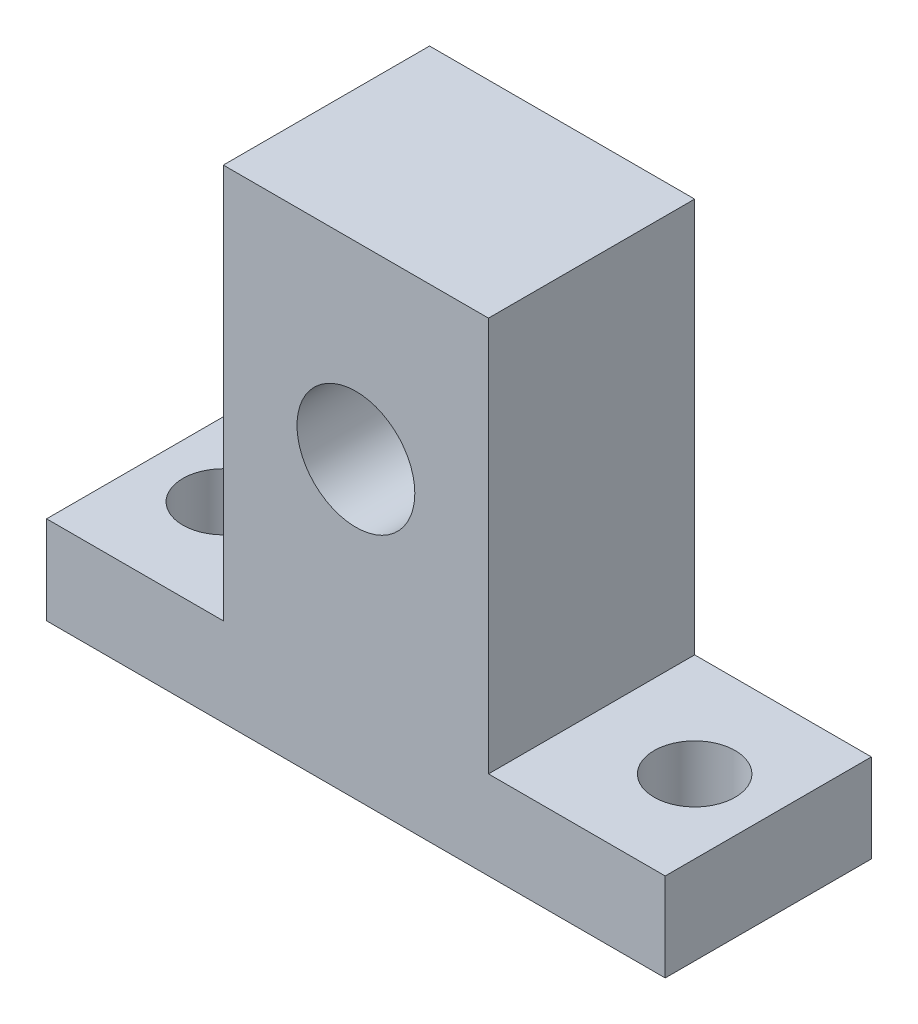
ISO-10303-21;
HEADER;
FILE_DESCRIPTION(('STEP AP214'),'2;1');
FILE_NAME('part.step','',(''),(''),'','','');
FILE_SCHEMA(('AUTOMOTIVE_DESIGN { 1 0 10303 214 1 1 1 1 }'));
ENDSEC;
DATA;
#1=APPLICATION_CONTEXT('core data for automotive mechanical design processes');
#2=APPLICATION_PROTOCOL_DEFINITION('international standard','automotive_design',2000,#1);
#3=PRODUCT_CONTEXT('',#1,'mechanical');
#4=PRODUCT('Part','Part','',(#3));
#5=PRODUCT_RELATED_PRODUCT_CATEGORY('part','',(#4));
#6=PRODUCT_DEFINITION_FORMATION('','',#4);
#7=PRODUCT_DEFINITION_CONTEXT('part definition',#1,'design');
#8=PRODUCT_DEFINITION('design','',#6,#7);
#9=PRODUCT_DEFINITION_SHAPE('','',#8);
#10=(LENGTH_UNIT() NAMED_UNIT(*) SI_UNIT(.MILLI.,.METRE.));
#11=(NAMED_UNIT(*) PLANE_ANGLE_UNIT() SI_UNIT($,.RADIAN.));
#12=(NAMED_UNIT(*) SI_UNIT($,.STERADIAN.) SOLID_ANGLE_UNIT());
#13=UNCERTAINTY_MEASURE_WITH_UNIT(LENGTH_MEASURE(1.E-05),#10,'distance_accuracy_value','');
#14=(GEOMETRIC_REPRESENTATION_CONTEXT(3) GLOBAL_UNCERTAINTY_ASSIGNED_CONTEXT((#13)) GLOBAL_UNIT_ASSIGNED_CONTEXT((#10,
#11,#12)) REPRESENTATION_CONTEXT('',''));
#15=CARTESIAN_POINT('',(0.,0.,0.));
#16=DIRECTION('',(0.,0.,1.));
#17=DIRECTION('',(1.,0.,0.));
#18=AXIS2_PLACEMENT_3D('',#15,#16,#17);
#19=CARTESIAN_POINT('',(0.,0.,14.));
#20=DIRECTION('',(0.,0.,1.));
#21=DIRECTION('',(1.,0.,0.));
#22=AXIS2_PLACEMENT_3D('',#19,#20,#21);
#23=PLANE('',#22);
#24=DIRECTION('',(0.,1.,0.));
#25=VECTOR('',#24,1.);
#26=CARTESIAN_POINT('',(21.,0.,14.));
#27=LINE('',#26,#25);
#28=CARTESIAN_POINT('',(21.,0.,14.));
#29=VERTEX_POINT('',#28);
#30=CARTESIAN_POINT('',(21.,6.,14.));
#31=VERTEX_POINT('',#30);
#32=EDGE_CURVE('E146',#29,#31,#27,.T.);
#33=ORIENTED_EDGE('',*,*,#32,.T.);
#34=DIRECTION('',(-1.,0.,0.));
#35=VECTOR('',#34,1.);
#36=CARTESIAN_POINT('',(21.,6.,14.));
#37=LINE('',#36,#35);
#38=CARTESIAN_POINT('',(9.,6.,14.));
#39=VERTEX_POINT('',#38);
#40=EDGE_CURVE('E94',#31,#39,#37,.T.);
#41=ORIENTED_EDGE('',*,*,#40,.T.);
#42=DIRECTION('',(0.,1.,0.));
#43=VECTOR('',#42,1.);
#44=CARTESIAN_POINT('',(9.,6.,14.));
#45=LINE('',#44,#43);
#46=CARTESIAN_POINT('',(9.,32.8,14.));
#47=VERTEX_POINT('',#46);
#48=EDGE_CURVE('E161',#39,#47,#45,.T.);
#49=ORIENTED_EDGE('',*,*,#48,.T.);
#50=DIRECTION('',(-1.,0.,0.));
#51=VECTOR('',#50,1.);
#52=CARTESIAN_POINT('',(9.,32.8,14.));
#53=LINE('',#52,#51);
#54=CARTESIAN_POINT('',(-9.,32.8,14.));
#55=VERTEX_POINT('',#54);
#56=EDGE_CURVE('E174',#47,#55,#53,.T.);
#57=ORIENTED_EDGE('',*,*,#56,.T.);
#58=DIRECTION('',(0.,-1.,0.));
#59=VECTOR('',#58,1.);
#60=CARTESIAN_POINT('',(-9.,32.8,14.));
#61=LINE('',#60,#59);
#62=CARTESIAN_POINT('',(-9.,5.99999999999999,14.));
#63=VERTEX_POINT('',#62);
#64=EDGE_CURVE('E113',#55,#63,#61,.T.);
#65=ORIENTED_EDGE('',*,*,#64,.T.);
#66=DIRECTION('',(-1.,0.,0.));
#67=VECTOR('',#66,1.);
#68=CARTESIAN_POINT('',(-9.,5.99999999999999,14.));
#69=LINE('',#68,#67);
#70=CARTESIAN_POINT('',(-21.,5.99999999999999,14.));
#71=VERTEX_POINT('',#70);
#72=EDGE_CURVE('E107',#63,#71,#69,.T.);
#73=ORIENTED_EDGE('',*,*,#72,.T.);
#74=DIRECTION('',(0.,-1.,0.));
#75=VECTOR('',#74,1.);
#76=CARTESIAN_POINT('',(-21.,5.99999999999999,14.));
#77=LINE('',#76,#75);
#78=CARTESIAN_POINT('',(-21.,0.,14.));
#79=VERTEX_POINT('',#78);
#80=EDGE_CURVE('E111',#71,#79,#77,.T.);
#81=ORIENTED_EDGE('',*,*,#80,.T.);
#82=DIRECTION('',(1.,0.,0.));
#83=VECTOR('',#82,1.);
#84=CARTESIAN_POINT('',(-21.,0.,14.));
#85=LINE('',#84,#83);
#86=EDGE_CURVE('E51',#79,#29,#85,.T.);
#87=ORIENTED_EDGE('',*,*,#86,.T.);
#88=EDGE_LOOP('',(#33,#41,#49,#57,#65,#73,#81,#87));
#89=FACE_BOUND('',#88,.T.);
#90=CARTESIAN_POINT('',(0.,20.,14.));
#91=DIRECTION('',(0.,0.,1.));
#92=DIRECTION('',(1.,0.,0.));
#93=AXIS2_PLACEMENT_3D('',#90,#91,#92);
#94=CIRCLE('',#93,4.);
#95=CARTESIAN_POINT('',(4.,20.,14.));
#96=VERTEX_POINT('',#95);
#97=EDGE_CURVE('E135',#96,#96,#94,.T.);
#98=ORIENTED_EDGE('',*,*,#97,.F.);
#99=EDGE_LOOP('',(#98));
#100=FACE_BOUND('',#99,.T.);
#101=ADVANCED_FACE('F34',(#89,#100),#23,.T.);
#102=CARTESIAN_POINT('',(0.,0.,0.));
#103=DIRECTION('',(0.,0.,1.));
#104=DIRECTION('',(1.,0.,0.));
#105=AXIS2_PLACEMENT_3D('',#102,#103,#104);
#106=PLANE('',#105);
#107=DIRECTION('',(0.,1.,0.));
#108=VECTOR('',#107,1.);
#109=CARTESIAN_POINT('',(21.,0.,0.));
#110=LINE('',#109,#108);
#111=CARTESIAN_POINT('',(21.,0.,0.));
#112=VERTEX_POINT('',#111);
#113=CARTESIAN_POINT('',(21.,6.,0.));
#114=VERTEX_POINT('',#113);
#115=EDGE_CURVE('E131',#112,#114,#110,.T.);
#116=ORIENTED_EDGE('',*,*,#115,.F.);
#117=DIRECTION('',(1.,0.,0.));
#118=VECTOR('',#117,1.);
#119=CARTESIAN_POINT('',(-21.,0.,0.));
#120=LINE('',#119,#118);
#121=CARTESIAN_POINT('',(-21.,0.,0.));
#122=VERTEX_POINT('',#121);
#123=EDGE_CURVE('E86',#122,#112,#120,.T.);
#124=ORIENTED_EDGE('',*,*,#123,.F.);
#125=DIRECTION('',(0.,-1.,0.));
#126=VECTOR('',#125,1.);
#127=CARTESIAN_POINT('',(-21.,5.99999999999999,0.));
#128=LINE('',#127,#126);
#129=CARTESIAN_POINT('',(-21.,5.99999999999999,0.));
#130=VERTEX_POINT('',#129);
#131=EDGE_CURVE('E80',#130,#122,#128,.T.);
#132=ORIENTED_EDGE('',*,*,#131,.F.);
#133=DIRECTION('',(-1.,0.,0.));
#134=VECTOR('',#133,1.);
#135=CARTESIAN_POINT('',(-9.,5.99999999999999,0.));
#136=LINE('',#135,#134);
#137=CARTESIAN_POINT('',(-9.,5.99999999999999,0.));
#138=VERTEX_POINT('',#137);
#139=EDGE_CURVE('E121',#138,#130,#136,.T.);
#140=ORIENTED_EDGE('',*,*,#139,.F.);
#141=DIRECTION('',(0.,-1.,0.));
#142=VECTOR('',#141,1.);
#143=CARTESIAN_POINT('',(-9.,32.8,0.));
#144=LINE('',#143,#142);
#145=CARTESIAN_POINT('',(-9.,32.8,0.));
#146=VERTEX_POINT('',#145);
#147=EDGE_CURVE('E141',#146,#138,#144,.T.);
#148=ORIENTED_EDGE('',*,*,#147,.F.);
#149=DIRECTION('',(-1.,0.,0.));
#150=VECTOR('',#149,1.);
#151=CARTESIAN_POINT('',(9.,32.8,0.));
#152=LINE('',#151,#150);
#153=CARTESIAN_POINT('',(9.,32.8,0.));
#154=VERTEX_POINT('',#153);
#155=EDGE_CURVE('E139',#154,#146,#152,.T.);
#156=ORIENTED_EDGE('',*,*,#155,.F.);
#157=DIRECTION('',(0.,1.,0.));
#158=VECTOR('',#157,1.);
#159=CARTESIAN_POINT('',(9.,6.,0.));
#160=LINE('',#159,#158);
#161=CARTESIAN_POINT('',(9.,6.,0.));
#162=VERTEX_POINT('',#161);
#163=EDGE_CURVE('E137',#162,#154,#160,.T.);
#164=ORIENTED_EDGE('',*,*,#163,.F.);
#165=DIRECTION('',(-1.,0.,0.));
#166=VECTOR('',#165,1.);
#167=CARTESIAN_POINT('',(21.,6.,0.));
#168=LINE('',#167,#166);
#169=EDGE_CURVE('E134',#114,#162,#168,.T.);
#170=ORIENTED_EDGE('',*,*,#169,.F.);
#171=EDGE_LOOP('',(#116,#124,#132,#140,#148,#156,#164,#170));
#172=FACE_BOUND('',#171,.T.);
#173=CARTESIAN_POINT('',(0.,20.,0.));
#174=DIRECTION('',(0.,0.,1.));
#175=DIRECTION('',(1.,0.,0.));
#176=AXIS2_PLACEMENT_3D('',#173,#174,#175);
#177=CIRCLE('',#176,4.);
#178=CARTESIAN_POINT('',(4.,20.,0.));
#179=VERTEX_POINT('',#178);
#180=EDGE_CURVE('E180',#179,#179,#177,.T.);
#181=ORIENTED_EDGE('',*,*,#180,.T.);
#182=EDGE_LOOP('',(#181));
#183=FACE_BOUND('',#182,.T.);
#184=ADVANCED_FACE('F165',(#172,#183),#106,.F.);
#185=CARTESIAN_POINT('',(21.,0.,14.));
#186=DIRECTION('',(-1.,0.,0.));
#187=DIRECTION('',(0.,-1.,0.));
#188=AXIS2_PLACEMENT_3D('',#185,#186,#187);
#189=PLANE('',#188);
#190=ORIENTED_EDGE('',*,*,#115,.T.);
#191=DIRECTION('',(0.,0.,-1.));
#192=VECTOR('',#191,1.);
#193=CARTESIAN_POINT('',(21.,6.,14.));
#194=LINE('',#193,#192);
#195=EDGE_CURVE('E11',#31,#114,#194,.T.);
#196=ORIENTED_EDGE('',*,*,#195,.F.);
#197=ORIENTED_EDGE('',*,*,#32,.F.);
#198=DIRECTION('',(0.,0.,-1.));
#199=VECTOR('',#198,1.);
#200=CARTESIAN_POINT('',(21.,0.,14.));
#201=LINE('',#200,#199);
#202=EDGE_CURVE('E127',#29,#112,#201,.T.);
#203=ORIENTED_EDGE('',*,*,#202,.T.);
#204=EDGE_LOOP('',(#190,#196,#197,#203));
#205=FACE_BOUND('',#204,.T.);
#206=ADVANCED_FACE('F36',(#205),#189,.F.);
#207=CARTESIAN_POINT('',(21.,6.,14.));
#208=DIRECTION('',(0.,-1.,0.));
#209=DIRECTION('',(0.,0.,-1.));
#210=AXIS2_PLACEMENT_3D('',#207,#208,#209);
#211=PLANE('',#210);
#212=CARTESIAN_POINT('',(16.,5.99999999999999,7.));
#213=DIRECTION('',(0.,1.,0.));
#214=DIRECTION('',(0.,0.,1.));
#215=AXIS2_PLACEMENT_3D('',#212,#213,#214);
#216=CIRCLE('',#215,2.75);
#217=CARTESIAN_POINT('',(16.,5.99999999999999,9.75));
#218=VERTEX_POINT('',#217);
#219=EDGE_CURVE('E190',#218,#218,#216,.T.);
#220=ORIENTED_EDGE('',*,*,#219,.F.);
#221=EDGE_LOOP('',(#220));
#222=FACE_BOUND('',#221,.T.);
#223=ORIENTED_EDGE('',*,*,#169,.T.);
#224=DIRECTION('',(0.,0.,-1.));
#225=VECTOR('',#224,1.);
#226=CARTESIAN_POINT('',(9.,6.,14.));
#227=LINE('',#226,#225);
#228=EDGE_CURVE('E43',#39,#162,#227,.T.);
#229=ORIENTED_EDGE('',*,*,#228,.F.);
#230=ORIENTED_EDGE('',*,*,#40,.F.);
#231=ORIENTED_EDGE('',*,*,#195,.T.);
#232=EDGE_LOOP('',(#223,#229,#230,#231));
#233=FACE_BOUND('',#232,.T.);
#234=ADVANCED_FACE('F234',(#222,#233),#211,.F.);
#235=CARTESIAN_POINT('',(9.,6.,14.));
#236=DIRECTION('',(-1.,0.,0.));
#237=DIRECTION('',(0.,-1.,0.));
#238=AXIS2_PLACEMENT_3D('',#235,#236,#237);
#239=PLANE('',#238);
#240=ORIENTED_EDGE('',*,*,#163,.T.);
#241=DIRECTION('',(0.,0.,-1.));
#242=VECTOR('',#241,1.);
#243=CARTESIAN_POINT('',(9.,32.8,14.));
#244=LINE('',#243,#242);
#245=EDGE_CURVE('E153',#47,#154,#244,.T.);
#246=ORIENTED_EDGE('',*,*,#245,.F.);
#247=ORIENTED_EDGE('',*,*,#48,.F.);
#248=ORIENTED_EDGE('',*,*,#228,.T.);
#249=EDGE_LOOP('',(#240,#246,#247,#248));
#250=FACE_BOUND('',#249,.T.);
#251=ADVANCED_FACE('F159',(#250),#239,.F.);
#252=CARTESIAN_POINT('',(9.,32.8,14.));
#253=DIRECTION('',(0.,-1.,0.));
#254=DIRECTION('',(0.,0.,-1.));
#255=AXIS2_PLACEMENT_3D('',#252,#253,#254);
#256=PLANE('',#255);
#257=ORIENTED_EDGE('',*,*,#155,.T.);
#258=DIRECTION('',(0.,0.,-1.));
#259=VECTOR('',#258,1.);
#260=CARTESIAN_POINT('',(-9.,32.8,14.));
#261=LINE('',#260,#259);
#262=EDGE_CURVE('E150',#55,#146,#261,.T.);
#263=ORIENTED_EDGE('',*,*,#262,.F.);
#264=ORIENTED_EDGE('',*,*,#56,.F.);
#265=ORIENTED_EDGE('',*,*,#245,.T.);
#266=EDGE_LOOP('',(#257,#263,#264,#265));
#267=FACE_BOUND('',#266,.T.);
#268=ADVANCED_FACE('F170',(#267),#256,.F.);
#269=CARTESIAN_POINT('',(-9.,32.8,14.));
#270=DIRECTION('',(1.,0.,0.));
#271=DIRECTION('',(0.,1.,0.));
#272=AXIS2_PLACEMENT_3D('',#269,#270,#271);
#273=PLANE('',#272);
#274=ORIENTED_EDGE('',*,*,#147,.T.);
#275=DIRECTION('',(0.,0.,-1.));
#276=VECTOR('',#275,1.);
#277=CARTESIAN_POINT('',(-9.,5.99999999999999,14.));
#278=LINE('',#277,#276);
#279=EDGE_CURVE('E122',#63,#138,#278,.T.);
#280=ORIENTED_EDGE('',*,*,#279,.F.);
#281=ORIENTED_EDGE('',*,*,#64,.F.);
#282=ORIENTED_EDGE('',*,*,#262,.T.);
#283=EDGE_LOOP('',(#274,#280,#281,#282));
#284=FACE_BOUND('',#283,.T.);
#285=ADVANCED_FACE('F173',(#284),#273,.F.);
#286=CARTESIAN_POINT('',(-9.,5.99999999999999,14.));
#287=DIRECTION('',(0.,-1.,0.));
#288=DIRECTION('',(0.,0.,-1.));
#289=AXIS2_PLACEMENT_3D('',#286,#287,#288);
#290=PLANE('',#289);
#291=CARTESIAN_POINT('',(-16.,5.99999999999999,7.));
#292=DIRECTION('',(0.,1.,0.));
#293=DIRECTION('',(0.,0.,1.));
#294=AXIS2_PLACEMENT_3D('',#291,#292,#293);
#295=CIRCLE('',#294,2.75);
#296=CARTESIAN_POINT('',(-16.,5.99999999999999,9.75));
#297=VERTEX_POINT('',#296);
#298=EDGE_CURVE('E189',#297,#297,#295,.T.);
#299=ORIENTED_EDGE('',*,*,#298,.F.);
#300=EDGE_LOOP('',(#299));
#301=FACE_BOUND('',#300,.T.);
#302=ORIENTED_EDGE('',*,*,#139,.T.);
#303=DIRECTION('',(0.,0.,-1.));
#304=VECTOR('',#303,1.);
#305=CARTESIAN_POINT('',(-21.,5.99999999999999,14.));
#306=LINE('',#305,#304);
#307=EDGE_CURVE('E118',#71,#130,#306,.T.);
#308=ORIENTED_EDGE('',*,*,#307,.F.);
#309=ORIENTED_EDGE('',*,*,#72,.F.);
#310=ORIENTED_EDGE('',*,*,#279,.T.);
#311=EDGE_LOOP('',(#302,#308,#309,#310));
#312=FACE_BOUND('',#311,.T.);
#313=ADVANCED_FACE('F119',(#301,#312),#290,.F.);
#314=CARTESIAN_POINT('',(-21.,5.99999999999999,14.));
#315=DIRECTION('',(1.,0.,0.));
#316=DIRECTION('',(0.,1.,0.));
#317=AXIS2_PLACEMENT_3D('',#314,#315,#316);
#318=PLANE('',#317);
#319=ORIENTED_EDGE('',*,*,#131,.T.);
#320=DIRECTION('',(0.,0.,-1.));
#321=VECTOR('',#320,1.);
#322=CARTESIAN_POINT('',(-21.,0.,14.));
#323=LINE('',#322,#321);
#324=EDGE_CURVE('E123',#79,#122,#323,.T.);
#325=ORIENTED_EDGE('',*,*,#324,.F.);
#326=ORIENTED_EDGE('',*,*,#80,.F.);
#327=ORIENTED_EDGE('',*,*,#307,.T.);
#328=EDGE_LOOP('',(#319,#325,#326,#327));
#329=FACE_BOUND('',#328,.T.);
#330=ADVANCED_FACE('F125',(#329),#318,.F.);
#331=CARTESIAN_POINT('',(-21.,0.,14.));
#332=DIRECTION('',(0.,1.,0.));
#333=DIRECTION('',(0.,0.,1.));
#334=AXIS2_PLACEMENT_3D('',#331,#332,#333);
#335=PLANE('',#334);
#336=CARTESIAN_POINT('',(-16.,0.,7.));
#337=DIRECTION('',(0.,1.,0.));
#338=DIRECTION('',(0.,0.,1.));
#339=AXIS2_PLACEMENT_3D('',#336,#337,#338);
#340=CIRCLE('',#339,2.75);
#341=CARTESIAN_POINT('',(-16.,0.,9.75));
#342=VERTEX_POINT('',#341);
#343=EDGE_CURVE('E183',#342,#342,#340,.F.);
#344=ORIENTED_EDGE('',*,*,#343,.F.);
#345=EDGE_LOOP('',(#344));
#346=FACE_BOUND('',#345,.T.);
#347=CARTESIAN_POINT('',(16.,0.,7.));
#348=DIRECTION('',(0.,1.,0.));
#349=DIRECTION('',(0.,0.,1.));
#350=AXIS2_PLACEMENT_3D('',#347,#348,#349);
#351=CIRCLE('',#350,2.75);
#352=CARTESIAN_POINT('',(16.,0.,9.75));
#353=VERTEX_POINT('',#352);
#354=EDGE_CURVE('E186',#353,#353,#351,.F.);
#355=ORIENTED_EDGE('',*,*,#354,.F.);
#356=EDGE_LOOP('',(#355));
#357=FACE_BOUND('',#356,.T.);
#358=ORIENTED_EDGE('',*,*,#123,.T.);
#359=ORIENTED_EDGE('',*,*,#202,.F.);
#360=ORIENTED_EDGE('',*,*,#86,.F.);
#361=ORIENTED_EDGE('',*,*,#324,.T.);
#362=EDGE_LOOP('',(#358,#359,#360,#361));
#363=FACE_BOUND('',#362,.T.);
#364=ADVANCED_FACE('F206',(#346,#357,#363),#335,.F.);
#365=CARTESIAN_POINT('',(0.,20.,14.));
#366=DIRECTION('',(0.,0.,-1.));
#367=DIRECTION('',(-1.,0.,0.));
#368=AXIS2_PLACEMENT_3D('',#365,#366,#367);
#369=CYLINDRICAL_SURFACE('',#368,4.);
#370=ORIENTED_EDGE('',*,*,#97,.T.);
#371=EDGE_LOOP('',(#370));
#372=FACE_BOUND('',#371,.T.);
#373=ORIENTED_EDGE('',*,*,#180,.F.);
#374=EDGE_LOOP('',(#373));
#375=FACE_BOUND('',#374,.T.);
#376=ADVANCED_FACE('F216',(#372,#375),#369,.F.);
#377=CARTESIAN_POINT('',(16.,-7.77817459305202,7.));
#378=DIRECTION('',(0.,1.,0.));
#379=DIRECTION('',(0.,0.,1.));
#380=AXIS2_PLACEMENT_3D('',#377,#378,#379);
#381=CYLINDRICAL_SURFACE('',#380,2.75);
#382=ORIENTED_EDGE('',*,*,#354,.T.);
#383=EDGE_LOOP('',(#382));
#384=FACE_BOUND('',#383,.T.);
#385=ORIENTED_EDGE('',*,*,#219,.T.);
#386=EDGE_LOOP('',(#385));
#387=FACE_BOUND('',#386,.T.);
#388=ADVANCED_FACE('F224',(#384,#387),#381,.F.);
#389=CARTESIAN_POINT('',(-16.,-7.77817459305202,7.));
#390=DIRECTION('',(0.,1.,0.));
#391=DIRECTION('',(0.,0.,1.));
#392=AXIS2_PLACEMENT_3D('',#389,#390,#391);
#393=CYLINDRICAL_SURFACE('',#392,2.75);
#394=ORIENTED_EDGE('',*,*,#343,.T.);
#395=EDGE_LOOP('',(#394));
#396=FACE_BOUND('',#395,.T.);
#397=ORIENTED_EDGE('',*,*,#298,.T.);
#398=EDGE_LOOP('',(#397));
#399=FACE_BOUND('',#398,.T.);
#400=ADVANCED_FACE('F198',(#396,#399),#393,.F.);
#401=CLOSED_SHELL('',(#101,#184,#206,#234,#251,#268,#285,#313,#330,#364,#376,#388,#400));
#402=MANIFOLD_SOLID_BREP('B2',#401);
#403=ADVANCED_BREP_SHAPE_REPRESENTATION('',(#18,#402),#14);
#404=SHAPE_DEFINITION_REPRESENTATION(#9,#403);
ENDSEC;
END-ISO-10303-21;
